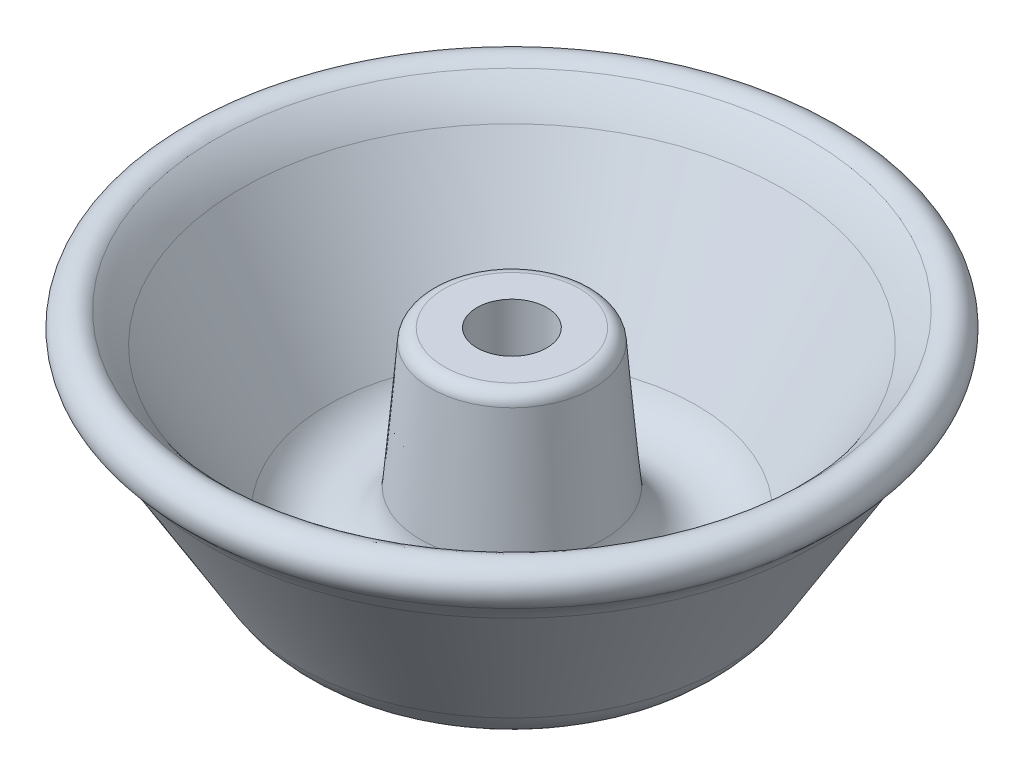
ISO-10303-21;
HEADER;
FILE_DESCRIPTION(('STEP AP214'),'2;1');
FILE_NAME('part.step','',(''),(''),'','','');
FILE_SCHEMA(('AUTOMOTIVE_DESIGN { 1 0 10303 214 1 1 1 1 }'));
ENDSEC;
DATA;
#1=APPLICATION_CONTEXT('core data for automotive mechanical design processes');
#2=APPLICATION_PROTOCOL_DEFINITION('international standard','automotive_design',2000,#1);
#3=PRODUCT_CONTEXT('',#1,'mechanical');
#4=PRODUCT('Part','Part','',(#3));
#5=PRODUCT_RELATED_PRODUCT_CATEGORY('part','',(#4));
#6=PRODUCT_DEFINITION_FORMATION('','',#4);
#7=PRODUCT_DEFINITION_CONTEXT('part definition',#1,'design');
#8=PRODUCT_DEFINITION('design','',#6,#7);
#9=PRODUCT_DEFINITION_SHAPE('','',#8);
#10=(LENGTH_UNIT() NAMED_UNIT(*) SI_UNIT(.MILLI.,.METRE.));
#11=(NAMED_UNIT(*) PLANE_ANGLE_UNIT() SI_UNIT($,.RADIAN.));
#12=(NAMED_UNIT(*) SI_UNIT($,.STERADIAN.) SOLID_ANGLE_UNIT());
#13=UNCERTAINTY_MEASURE_WITH_UNIT(LENGTH_MEASURE(1.E-05),#10,'distance_accuracy_value','');
#14=(GEOMETRIC_REPRESENTATION_CONTEXT(3) GLOBAL_UNCERTAINTY_ASSIGNED_CONTEXT((#13)) GLOBAL_UNIT_ASSIGNED_CONTEXT((#10,
#11,#12)) REPRESENTATION_CONTEXT('',''));
#15=CARTESIAN_POINT('',(0.,0.,0.));
#16=DIRECTION('',(0.,0.,1.));
#17=DIRECTION('',(1.,0.,0.));
#18=AXIS2_PLACEMENT_3D('',#15,#16,#17);
#19=CARTESIAN_POINT('',(0.,0.,0.));
#20=DIRECTION('',(0.,-1.,0.));
#21=DIRECTION('',(0.,0.,-1.));
#22=AXIS2_PLACEMENT_3D('',#19,#20,#21);
#23=CYLINDRICAL_SURFACE('',#22,4.1671875);
#24=CARTESIAN_POINT('',(0.,11.90625,0.));
#25=DIRECTION('',(0.,-1.,0.));
#26=DIRECTION('',(0.,0.,-1.));
#27=AXIS2_PLACEMENT_3D('',#24,#25,#26);
#28=CIRCLE('',#27,4.1671875);
#29=CARTESIAN_POINT('',(0.,11.90625,-4.1671875));
#30=VERTEX_POINT('',#29);
#31=EDGE_CURVE('E10',#30,#30,#28,.T.);
#32=ORIENTED_EDGE('',*,*,#31,.T.);
#33=EDGE_LOOP('',(#32));
#34=FACE_BOUND('',#33,.T.);
#35=CARTESIAN_POINT('',(0.,27.78125,0.));
#36=DIRECTION('',(0.,-1.,0.));
#37=DIRECTION('',(0.,0.,-1.));
#38=AXIS2_PLACEMENT_3D('',#35,#36,#37);
#39=CIRCLE('',#38,4.1671875);
#40=CARTESIAN_POINT('',(0.,27.78125,-4.1671875));
#41=VERTEX_POINT('',#40);
#42=EDGE_CURVE('E71',#41,#41,#39,.T.);
#43=ORIENTED_EDGE('',*,*,#42,.F.);
#44=EDGE_LOOP('',(#43));
#45=FACE_BOUND('',#44,.T.);
#46=ADVANCED_FACE('F31',(#34,#45),#23,.F.);
#47=CARTESIAN_POINT('',(0.,11.90625,0.));
#48=DIRECTION('',(0.,-1.,0.));
#49=DIRECTION('',(0.,0.,-1.));
#50=AXIS2_PLACEMENT_3D('',#47,#48,#49);
#51=TOROIDAL_SURFACE('',#50,16.8671875,12.7);
#52=CARTESIAN_POINT('',(0.,7.43073560811613,0.));
#53=DIRECTION('',(0.,-1.,0.));
#54=DIRECTION('',(0.,0.,-1.));
#55=AXIS2_PLACEMENT_3D('',#52,#53,#54);
#56=CIRCLE('',#55,4.98191211707175);
#57=CARTESIAN_POINT('',(0.,7.43073560811613,-4.98191211707175));
#58=VERTEX_POINT('',#57);
#59=EDGE_CURVE('E37',#58,#58,#56,.T.);
#60=ORIENTED_EDGE('',*,*,#59,.T.);
#61=EDGE_LOOP('',(#60));
#62=FACE_BOUND('',#61,.T.);
#63=ORIENTED_EDGE('',*,*,#31,.F.);
#64=EDGE_LOOP('',(#63));
#65=FACE_BOUND('',#64,.T.);
#66=ADVANCED_FACE('F79',(#62,#65),#51,.T.);
#67=CARTESIAN_POINT('',(0.,11.474315442895,0.));
#68=DIRECTION('',(0.,-1.,0.));
#69=DIRECTION('',(0.,0.,-1.));
#70=AXIS2_PLACEMENT_3D('',#67,#68,#69);
#71=TOROIDAL_SURFACE('',#70,15.7201325004886,11.474315442895);
#72=CARTESIAN_POINT('',(0.,5.54350520047781,0.));
#73=DIRECTION('',(0.,-1.,0.));
#74=DIRECTION('',(0.,0.,-1.));
#75=AXIS2_PLACEMENT_3D('',#72,#73,#74);
#76=CIRCLE('',#75,25.5428309460023);
#77=CARTESIAN_POINT('',(0.,5.54350520047781,-25.5428309460023));
#78=VERTEX_POINT('',#77);
#79=EDGE_CURVE('E41',#78,#78,#76,.T.);
#80=ORIENTED_EDGE('',*,*,#79,.T.);
#81=EDGE_LOOP('',(#80));
#82=FACE_BOUND('',#81,.T.);
#83=ORIENTED_EDGE('',*,*,#59,.F.);
#84=EDGE_LOOP('',(#83));
#85=FACE_BOUND('',#84,.T.);
#86=ADVANCED_FACE('F83',(#82,#85),#71,.T.);
#87=CARTESIAN_POINT('',(0.,5.54350520047781,0.));
#88=DIRECTION('',(0.,1.,0.));
#89=DIRECTION('',(0.,0.,1.));
#90=AXIS2_PLACEMENT_3D('',#87,#88,#89);
#91=CONICAL_SURFACE('',#90,25.5428309460023,0.543198856544391);
#92=CARTESIAN_POINT('',(0.,23.520741869727,0.));
#93=DIRECTION('',(0.,-1.,0.));
#94=DIRECTION('',(0.,0.,-1.));
#95=AXIS2_PLACEMENT_3D('',#92,#93,#94);
#96=CIRCLE('',#95,36.3972392289969);
#97=CARTESIAN_POINT('',(0.,23.520741869727,-36.3972392289969));
#98=VERTEX_POINT('',#97);
#99=EDGE_CURVE('E45',#98,#98,#96,.T.);
#100=ORIENTED_EDGE('',*,*,#99,.T.);
#101=EDGE_LOOP('',(#100));
#102=FACE_BOUND('',#101,.T.);
#103=ORIENTED_EDGE('',*,*,#79,.F.);
#104=EDGE_LOOP('',(#103));
#105=FACE_BOUND('',#104,.T.);
#106=ADVANCED_FACE('F87',(#102,#105),#91,.T.);
#107=CARTESIAN_POINT('',(0.,18.187216877015,0.));
#108=DIRECTION('',(0.,-1.,0.));
#109=DIRECTION('',(0.,0.,-1.));
#110=AXIS2_PLACEMENT_3D('',#107,#108,#109);
#111=TOROIDAL_SURFACE('',#110,45.2307047275776,10.31875);
#112=CARTESIAN_POINT('',(0.,25.9823687894403,0.));
#113=DIRECTION('',(0.,-1.,0.));
#114=DIRECTION('',(0.,0.,-1.));
#115=AXIS2_PLACEMENT_3D('',#112,#113,#114);
#116=CIRCLE('',#115,38.4696243239208);
#117=CARTESIAN_POINT('',(0.,25.9823687894403,-38.4696243239208));
#118=VERTEX_POINT('',#117);
#119=EDGE_CURVE('E50',#118,#118,#116,.T.);
#120=ORIENTED_EDGE('',*,*,#119,.T.);
#121=EDGE_LOOP('',(#120));
#122=FACE_BOUND('',#121,.T.);
#123=ORIENTED_EDGE('',*,*,#99,.F.);
#124=EDGE_LOOP('',(#123));
#125=FACE_BOUND('',#124,.T.);
#126=ADVANCED_FACE('F94',(#122,#125),#111,.F.);
#127=CARTESIAN_POINT('',(0.,27.78125,0.));
#128=DIRECTION('',(0.,-1.,0.));
#129=DIRECTION('',(0.,0.,-1.));
#130=AXIS2_PLACEMENT_3D('',#127,#128,#129);
#131=TOROIDAL_SURFACE('',#130,36.909375,2.38125);
#132=CARTESIAN_POINT('',(0.,29.5801312105597,0.));
#133=DIRECTION('',(0.,-1.,0.));
#134=DIRECTION('',(0.,0.,-1.));
#135=AXIS2_PLACEMENT_3D('',#132,#133,#134);
#136=CIRCLE('',#135,35.3491256760792);
#137=CARTESIAN_POINT('',(0.,29.5801312105597,-35.3491256760792));
#138=VERTEX_POINT('',#137);
#139=EDGE_CURVE('E53',#138,#138,#136,.T.);
#140=ORIENTED_EDGE('',*,*,#139,.T.);
#141=EDGE_LOOP('',(#140));
#142=FACE_BOUND('',#141,.T.);
#143=ORIENTED_EDGE('',*,*,#119,.F.);
#144=EDGE_LOOP('',(#143));
#145=FACE_BOUND('',#144,.T.);
#146=ADVANCED_FACE('F98',(#142,#145),#131,.T.);
#147=CARTESIAN_POINT('',(0.,18.187216877015,0.));
#148=DIRECTION('',(0.,-1.,0.));
#149=DIRECTION('',(0.,0.,-1.));
#150=AXIS2_PLACEMENT_3D('',#147,#148,#149);
#151=TOROIDAL_SURFACE('',#150,45.2307047275776,15.08125);
#152=CARTESIAN_POINT('',(0.,25.9823687894403,0.));
#153=DIRECTION('',(0.,-1.,0.));
#154=DIRECTION('',(0.,0.,-1.));
#155=AXIS2_PLACEMENT_3D('',#152,#153,#154);
#156=CIRCLE('',#155,32.3202551527288);
#157=CARTESIAN_POINT('',(0.,25.9823687894403,-32.3202551527288));
#158=VERTEX_POINT('',#157);
#159=EDGE_CURVE('E56',#158,#158,#156,.T.);
#160=ORIENTED_EDGE('',*,*,#159,.T.);
#161=EDGE_LOOP('',(#160));
#162=FACE_BOUND('',#161,.T.);
#163=ORIENTED_EDGE('',*,*,#139,.F.);
#164=EDGE_LOOP('',(#163));
#165=FACE_BOUND('',#164,.T.);
#166=ADVANCED_FACE('F102',(#162,#165),#151,.T.);
#167=CARTESIAN_POINT('',(0.,25.9823687894403,0.));
#168=DIRECTION('',(0.,1.,0.));
#169=DIRECTION('',(0.,0.,1.));
#170=AXIS2_PLACEMENT_3D('',#167,#168,#169);
#171=CONICAL_SURFACE('',#170,32.3202551527288,0.54319885654439);
#172=CARTESIAN_POINT('',(0.,8.82921635035842,0.));
#173=DIRECTION('',(0.,-1.,0.));
#174=DIRECTION('',(0.,0.,-1.));
#175=AXIS2_PLACEMENT_3D('',#172,#173,#174);
#176=CIRCLE('',#175,21.963417595335);
#177=CARTESIAN_POINT('',(0.,8.82921635035842,-21.963417595335));
#178=VERTEX_POINT('',#177);
#179=EDGE_CURVE('E59',#178,#178,#176,.T.);
#180=ORIENTED_EDGE('',*,*,#179,.T.);
#181=EDGE_LOOP('',(#180));
#182=FACE_BOUND('',#181,.T.);
#183=ORIENTED_EDGE('',*,*,#159,.F.);
#184=EDGE_LOOP('',(#183));
#185=FACE_BOUND('',#184,.T.);
#186=ADVANCED_FACE('F106',(#182,#185),#171,.F.);
#187=CARTESIAN_POINT('',(0.,11.90625,0.));
#188=DIRECTION('',(0.,-1.,0.));
#189=DIRECTION('',(0.,0.,-1.));
#190=AXIS2_PLACEMENT_3D('',#187,#188,#189);
#191=TOROIDAL_SURFACE('',#190,16.8671875,5.953125);
#192=CARTESIAN_POINT('',(0.,11.3955034999716,0.));
#193=DIRECTION('',(0.,-1.,0.));
#194=DIRECTION('',(0.,0.,-1.));
#195=AXIS2_PLACEMENT_3D('',#192,#193,#194);
#196=CIRCLE('',#195,10.9360126350737);
#197=CARTESIAN_POINT('',(0.,11.3955034999716,-10.9360126350737));
#198=VERTEX_POINT('',#197);
#199=EDGE_CURVE('E62',#198,#198,#196,.T.);
#200=ORIENTED_EDGE('',*,*,#199,.T.);
#201=EDGE_LOOP('',(#200));
#202=FACE_BOUND('',#201,.T.);
#203=ORIENTED_EDGE('',*,*,#179,.F.);
#204=EDGE_LOOP('',(#203));
#205=FACE_BOUND('',#204,.T.);
#206=ADVANCED_FACE('F110',(#202,#205),#191,.F.);
#207=CARTESIAN_POINT('',(0.,11.3955034999716,0.));
#208=DIRECTION('',(0.,-1.,0.));
#209=DIRECTION('',(0.,0.,-1.));
#210=AXIS2_PLACEMENT_3D('',#207,#208,#209);
#211=CONICAL_SURFACE('',#210,10.9360126350737,0.085900289732255);
#212=CARTESIAN_POINT('',(0.,26.3299490666742,0.));
#213=DIRECTION('',(0.,-1.,0.));
#214=DIRECTION('',(0.,0.,-1.));
#215=AXIS2_PLACEMENT_3D('',#212,#213,#214);
#216=CIRCLE('',#215,9.64997471227285);
#217=CARTESIAN_POINT('',(0.,26.3299490666742,-9.64997471227285));
#218=VERTEX_POINT('',#217);
#219=EDGE_CURVE('E65',#218,#218,#216,.T.);
#220=ORIENTED_EDGE('',*,*,#219,.T.);
#221=EDGE_LOOP('',(#220));
#222=FACE_BOUND('',#221,.T.);
#223=ORIENTED_EDGE('',*,*,#199,.F.);
#224=EDGE_LOOP('',(#223));
#225=FACE_BOUND('',#224,.T.);
#226=ADVANCED_FACE('F114',(#222,#225),#211,.T.);
#227=CARTESIAN_POINT('',(0.,26.19375,0.));
#228=DIRECTION('',(0.,-1.,0.));
#229=DIRECTION('',(0.,0.,-1.));
#230=AXIS2_PLACEMENT_3D('',#227,#228,#229);
#231=TOROIDAL_SURFACE('',#230,8.06832808162583,1.5875);
#232=CARTESIAN_POINT('',(0.,27.78125,0.));
#233=DIRECTION('',(0.,-1.,0.));
#234=DIRECTION('',(0.,0.,-1.));
#235=AXIS2_PLACEMENT_3D('',#232,#233,#234);
#236=CIRCLE('',#235,8.06832808162582);
#237=CARTESIAN_POINT('',(0.,27.78125,-8.06832808162582));
#238=VERTEX_POINT('',#237);
#239=EDGE_CURVE('E68',#238,#238,#236,.T.);
#240=ORIENTED_EDGE('',*,*,#239,.T.);
#241=EDGE_LOOP('',(#240));
#242=FACE_BOUND('',#241,.T.);
#243=ORIENTED_EDGE('',*,*,#219,.F.);
#244=EDGE_LOOP('',(#243));
#245=FACE_BOUND('',#244,.T.);
#246=ADVANCED_FACE('F118',(#242,#245),#231,.T.);
#247=CARTESIAN_POINT('',(4.1671875,27.78125,0.));
#248=DIRECTION('',(0.,1.,0.));
#249=DIRECTION('',(0.,0.,1.));
#250=AXIS2_PLACEMENT_3D('',#247,#248,#249);
#251=PLANE('',#250);
#252=ORIENTED_EDGE('',*,*,#42,.T.);
#253=EDGE_LOOP('',(#252));
#254=FACE_BOUND('',#253,.T.);
#255=ORIENTED_EDGE('',*,*,#239,.F.);
#256=EDGE_LOOP('',(#255));
#257=FACE_BOUND('',#256,.T.);
#258=ADVANCED_FACE('F75',(#254,#257),#251,.T.);
#259=CLOSED_SHELL('',(#46,#66,#86,#106,#126,#146,#166,#186,#206,#226,#246,#258));
#260=MANIFOLD_SOLID_BREP('B2',#259);
#261=ADVANCED_BREP_SHAPE_REPRESENTATION('',(#18,#260),#14);
#262=SHAPE_DEFINITION_REPRESENTATION(#9,#261);
ENDSEC;
END-ISO-10303-21;
